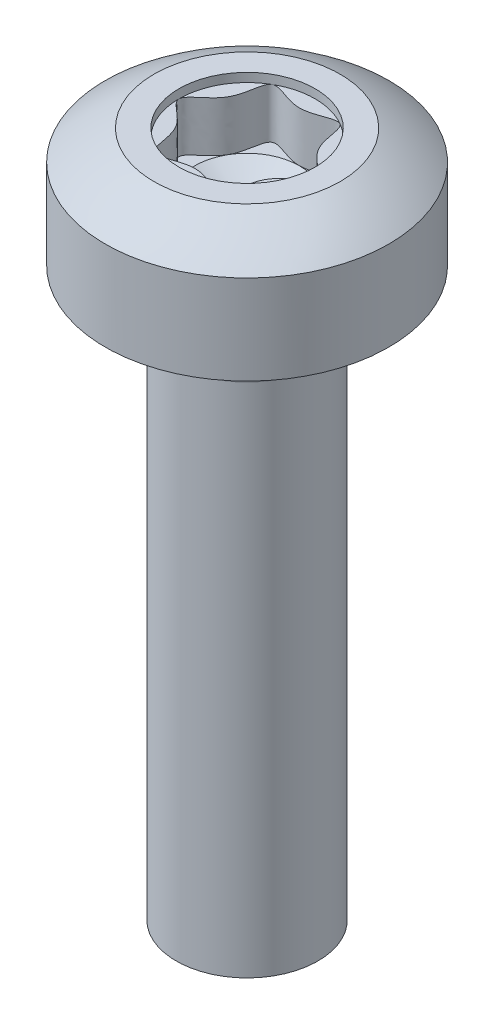
ISO-10303-21;
HEADER;
FILE_DESCRIPTION(('STEP AP214'),'2;1');
FILE_NAME('part.step','',(''),(''),'','','');
FILE_SCHEMA(('AUTOMOTIVE_DESIGN { 1 0 10303 214 1 1 1 1 }'));
ENDSEC;
DATA;
#1=APPLICATION_CONTEXT('core data for automotive mechanical design processes');
#2=APPLICATION_PROTOCOL_DEFINITION('international standard','automotive_design',2000,#1);
#3=PRODUCT_CONTEXT('',#1,'mechanical');
#4=PRODUCT('Part','Part','',(#3));
#5=PRODUCT_RELATED_PRODUCT_CATEGORY('part','',(#4));
#6=PRODUCT_DEFINITION_FORMATION('','',#4);
#7=PRODUCT_DEFINITION_CONTEXT('part definition',#1,'design');
#8=PRODUCT_DEFINITION('design','',#6,#7);
#9=PRODUCT_DEFINITION_SHAPE('','',#8);
#10=(LENGTH_UNIT() NAMED_UNIT(*) SI_UNIT(.MILLI.,.METRE.));
#11=(NAMED_UNIT(*) PLANE_ANGLE_UNIT() SI_UNIT($,.RADIAN.));
#12=(NAMED_UNIT(*) SI_UNIT($,.STERADIAN.) SOLID_ANGLE_UNIT());
#13=UNCERTAINTY_MEASURE_WITH_UNIT(LENGTH_MEASURE(1.E-05),#10,'distance_accuracy_value','');
#14=(GEOMETRIC_REPRESENTATION_CONTEXT(3) GLOBAL_UNCERTAINTY_ASSIGNED_CONTEXT((#13)) GLOBAL_UNIT_ASSIGNED_CONTEXT((#10,
#11,#12)) REPRESENTATION_CONTEXT('',''));
#15=CARTESIAN_POINT('',(0.,0.,0.));
#16=DIRECTION('',(0.,0.,1.));
#17=DIRECTION('',(1.,0.,0.));
#18=AXIS2_PLACEMENT_3D('',#15,#16,#17);
#19=CARTESIAN_POINT('',(0.,0.,0.));
#20=DIRECTION('',(0.,-1.,0.));
#21=DIRECTION('',(0.,0.,-1.));
#22=AXIS2_PLACEMENT_3D('',#19,#20,#21);
#23=CYLINDRICAL_SURFACE('',#22,2.5);
#24=CARTESIAN_POINT('',(0.,10.,0.));
#25=DIRECTION('',(0.,-1.,0.));
#26=DIRECTION('',(0.,0.,-1.));
#27=AXIS2_PLACEMENT_3D('',#24,#25,#26);
#28=CIRCLE('',#27,2.5);
#29=CARTESIAN_POINT('',(0.,10.,-2.5));
#30=VERTEX_POINT('',#29);
#31=EDGE_CURVE('E137',#30,#30,#28,.T.);
#32=ORIENTED_EDGE('',*,*,#31,.F.);
#33=EDGE_LOOP('',(#32));
#34=FACE_BOUND('',#33,.T.);
#35=CARTESIAN_POINT('',(0.,11.575,0.));
#36=DIRECTION('',(0.,-1.,0.));
#37=DIRECTION('',(0.,0.,-1.));
#38=AXIS2_PLACEMENT_3D('',#35,#36,#37);
#39=CIRCLE('',#38,2.5);
#40=CARTESIAN_POINT('',(2.5,11.575,0.));
#41=VERTEX_POINT('',#40);
#42=EDGE_CURVE('E142',#41,#41,#39,.T.);
#43=ORIENTED_EDGE('',*,*,#42,.T.);
#44=EDGE_LOOP('',(#43));
#45=FACE_BOUND('',#44,.T.);
#46=ADVANCED_FACE('F39',(#34,#45),#23,.T.);
#47=CARTESIAN_POINT('',(1.25,10.,0.));
#48=DIRECTION('',(0.,-1.,0.));
#49=DIRECTION('',(0.,0.,-1.));
#50=AXIS2_PLACEMENT_3D('',#47,#48,#49);
#51=PLANE('',#50);
#52=ORIENTED_EDGE('',*,*,#31,.T.);
#53=EDGE_LOOP('',(#52));
#54=FACE_BOUND('',#53,.T.);
#55=CARTESIAN_POINT('',(0.,10.,0.));
#56=DIRECTION('',(0.,-1.,0.));
#57=DIRECTION('',(0.,0.,-1.));
#58=AXIS2_PLACEMENT_3D('',#55,#56,#57);
#59=CIRCLE('',#58,1.25);
#60=CARTESIAN_POINT('',(0.,10.,-1.25));
#61=VERTEX_POINT('',#60);
#62=EDGE_CURVE('E302',#61,#61,#59,.T.);
#63=ORIENTED_EDGE('',*,*,#62,.F.);
#64=EDGE_LOOP('',(#63));
#65=FACE_BOUND('',#64,.T.);
#66=ADVANCED_FACE('F271',(#54,#65),#51,.T.);
#67=CARTESIAN_POINT('',(0.,8.4525010008008,0.));
#68=DIRECTION('',(0.,-1.,0.));
#69=DIRECTION('',(1.,0.,0.));
#70=AXIS2_PLACEMENT_3D('',#67,#68,#69);
#71=SPHERICAL_SURFACE('',#70,4.);
#72=CARTESIAN_POINT('',(0.,12.1,0.));
#73=DIRECTION('',(0.,1.,0.));
#74=DIRECTION('',(0.,0.,1.));
#75=AXIS2_PLACEMENT_3D('',#72,#73,#74);
#76=CIRCLE('',#75,1.6418742493994);
#77=CARTESIAN_POINT('',(1.6418742493994,12.1,0.));
#78=VERTEX_POINT('',#77);
#79=EDGE_CURVE('E146',#78,#78,#76,.T.);
#80=CARTESIAN_POINT('',(2.5,11.575,0.));
#81=CARTESIAN_POINT('',(2.49179811667303,11.5815667633569,0.));
#82=CARTESIAN_POINT('',(2.48357035879982,11.5881012093958,0.));
#83=CARTESIAN_POINT('',(2.46706360738007,11.6011050642602,0.));
#84=CARTESIAN_POINT('',(2.45878461383353,11.6075744730857,0.));
#85=CARTESIAN_POINT('',(2.44217590448631,11.6204478509464,0.));
#86=CARTESIAN_POINT('',(2.43384618868563,11.6268518199815,0.));
#87=CARTESIAN_POINT('',(2.4171365522514,11.6395939208298,0.));
#88=CARTESIAN_POINT('',(2.40875663161786,11.645932052643,0.));
#89=CARTESIAN_POINT('',(2.39194710582831,11.6585420854141,0.));
#90=CARTESIAN_POINT('',(2.3835175006723,11.6648139863721,0.));
#91=CARTESIAN_POINT('',(2.36660912929461,11.67729116799,0.));
#92=CARTESIAN_POINT('',(2.35813036307294,11.6834964486499,0.));
#93=CARTESIAN_POINT('',(2.34112419605702,11.6958400043448,0.));
#94=CARTESIAN_POINT('',(2.33259679526277,11.7019782793798,0.));
#95=CARTESIAN_POINT('',(2.31549388861922,11.7141874426645,0.));
#96=CARTESIAN_POINT('',(2.30691838276991,11.7202583309141,0.));
#97=CARTESIAN_POINT('',(2.28971979851967,11.7323323436503,0.));
#98=CARTESIAN_POINT('',(2.28109672011874,11.738335468137,0.));
#99=CARTESIAN_POINT('',(2.26380352622309,11.7502735805781,0.));
#100=CARTESIAN_POINT('',(2.25513341072836,11.7562085685325,0.));
#101=CARTESIAN_POINT('',(2.23774668102368,11.7680100393707,0.));
#102=CARTESIAN_POINT('',(2.22903006681372,11.7738765222544,0.));
#103=CARTESIAN_POINT('',(2.2115508809445,11.7855406186668,0.));
#104=CARTESIAN_POINT('',(2.20278830928525,11.7913382321955,0.));
#105=CARTESIAN_POINT('',(2.18521775263718,11.8028642298896,0.));
#106=CARTESIAN_POINT('',(2.17640976764836,11.8085926140551,0.));
#107=CARTESIAN_POINT('',(2.15874893128084,11.8199797973138,0.));
#108=CARTESIAN_POINT('',(2.14989607990214,11.8256385964071,0.));
#109=CARTESIAN_POINT('',(2.1321460604806,11.8368862581331,0.));
#110=CARTESIAN_POINT('',(2.12324889243774,11.8424751207659,0.));
#111=CARTESIAN_POINT('',(2.10541079216548,11.8535825625256,0.));
#112=CARTESIAN_POINT('',(2.09646985993607,11.8591011416525,0.));
#113=CARTESIAN_POINT('',(2.07854478648588,11.8700676737193,0.));
#114=CARTESIAN_POINT('',(2.06956064526509,11.8755156266593,0.));
#115=CARTESIAN_POINT('',(2.05154971171041,11.8863405680567,0.));
#116=CARTESIAN_POINT('',(2.04252291937652,11.8917175565141,0.));
#117=CARTESIAN_POINT('',(2.02442724412237,11.9024002350577,0.));
#118=CARTESIAN_POINT('',(2.01535836120211,11.9077059251437,0.));
#119=CARTESIAN_POINT('',(1.99717906791562,11.9182456774829,0.));
#120=CARTESIAN_POINT('',(1.98806865754939,11.9234797397361,0.));
#121=CARTESIAN_POINT('',(1.96980687509001,11.9338759113956,0.));
#122=CARTESIAN_POINT('',(1.96065550299687,11.939038020802,0.));
#123=CARTESIAN_POINT('',(1.94231236534631,11.9492899662223,0.));
#124=CARTESIAN_POINT('',(1.93312059978889,11.9543798022362,0.));
#125=CARTESIAN_POINT('',(1.91469724598067,11.9644868848136,0.));
#126=CARTESIAN_POINT('',(1.90546565772987,11.969504131377,0.));
#127=CARTESIAN_POINT('',(1.88696323177861,11.9794657235031,0.));
#128=CARTESIAN_POINT('',(1.87769239407816,11.9844100690658,0.));
#129=CARTESIAN_POINT('',(1.85911204490851,11.9942255521665,0.));
#130=CARTESIAN_POINT('',(1.84980253343931,11.9990966897047,0.));
#131=CARTESIAN_POINT('',(1.83114541481477,12.0087654542793,0.));
#132=CARTESIAN_POINT('',(1.82179780765943,12.0135630813157,0.));
#133=CARTESIAN_POINT('',(1.80306507811,12.0230845269725,0.));
#134=CARTESIAN_POINT('',(1.7936799557159,12.0278083455928,0.));
#135=CARTESIAN_POINT('',(1.77487277846887,12.0371818810928,0.));
#136=CARTESIAN_POINT('',(1.76545072361593,12.0418315979725,0.));
#137=CARTESIAN_POINT('',(1.74657026651338,12.0510566412438,0.));
#138=CARTESIAN_POINT('',(1.73711186426377,12.0556319676355,0.));
#139=CARTESIAN_POINT('',(1.71815929972841,12.0647079458926,0.));
#140=CARTESIAN_POINT('',(1.70866513744266,12.0692085977582,0.));
#141=CARTESIAN_POINT('',(1.68964164226191,12.0781349472266,0.));
#142=CARTESIAN_POINT('',(1.68011230936692,12.0825606448295,0.));
#143=CARTESIAN_POINT('',(1.6610190651539,12.0913368119422,0.));
#144=CARTESIAN_POINT('',(1.65145515383586,12.095687281452,0.));
#145=CARTESIAN_POINT('',(1.6418742493994,12.1,0.));
#146=B_SPLINE_CURVE_WITH_KNOTS('',3,(#80,#81,#82,#83,#84,#85,#86,#87,#88,#89,#90,#91,#92,#93,
#94,#95,#96,#97,#98,#99,#100,#101,#102,#103,#104,#105,#106,#107,#108,#109,#110,#111,#112,#113,
#114,#115,#116,#117,#118,#119,#120,#121,#122,#123,#124,#125,#126,#127,#128,#129,#130,#131,#132,
#133,#134,#135,#136,#137,#138,#139,#140,#141,#142,#143,#144,#145),.UNSPECIFIED.,.F.,.F.,(4,2,2,
2,2,2,2,2,2,2,2,2,2,2,2,2,2,2,2,2,2,2,2,2,2,2,2,2,2,2,2,2,4),(0.,0.031520379078916,
0.0630407581578305,0.0945611372367455,0.126081516315661,0.157601895394577,0.189122274473491,
0.220642653552406,0.252163032631322,0.283683411710237,0.315203790789152,0.346724169868067,
0.378244548946983,0.409764928025898,0.441285307104812,0.472805686183728,0.504326065262644,
0.535846444341557,0.567366823420474,0.598887202499389,0.630407581578304,0.661927960657219,
0.693448339736134,0.724968718815049,0.756489097893965,0.78800947697288,0.819529856051795,
0.851050235130711,0.882570614209625,0.91409099328854,0.945611372367456,0.977131751446371,
1.00865213052529),.UNSPECIFIED.);
#147=EDGE_CURVE('BSEAM277',#41,#78,#146,.T.);
#148=ORIENTED_EDGE('',*,*,#42,.F.);
#149=ORIENTED_EDGE('',*,*,#79,.F.);
#150=ORIENTED_EDGE('',*,*,#147,.T.);
#151=ORIENTED_EDGE('',*,*,#147,.F.);
#152=EDGE_LOOP('',(#148,#150,#149,#151));
#153=FACE_BOUND('',#152,.T.);
#154=ADVANCED_FACE('F277',(#153),#71,.T.);
#155=CARTESIAN_POINT('',(2.5,12.1,0.));
#156=DIRECTION('',(0.,1.,0.));
#157=DIRECTION('',(0.,0.,1.));
#158=AXIS2_PLACEMENT_3D('',#155,#156,#157);
#159=PLANE('',#158);
#160=CARTESIAN_POINT('',(0.,12.1,0.));
#161=DIRECTION('',(0.,1.,0.));
#162=DIRECTION('',(0.,0.,1.));
#163=AXIS2_PLACEMENT_3D('',#160,#161,#162);
#164=CIRCLE('',#163,1.2);
#165=CARTESIAN_POINT('',(0.,12.1,1.2));
#166=VERTEX_POINT('',#165);
#167=EDGE_CURVE('E322',#166,#166,#164,.T.);
#168=ORIENTED_EDGE('',*,*,#167,.F.);
#169=EDGE_LOOP('',(#168));
#170=FACE_BOUND('',#169,.T.);
#171=ORIENTED_EDGE('',*,*,#79,.T.);
#172=EDGE_LOOP('',(#171));
#173=FACE_BOUND('',#172,.T.);
#174=ADVANCED_FACE('F283',(#170,#173),#159,.T.);
#175=CARTESIAN_POINT('',(0.,9.1,0.));
#176=DIRECTION('',(0.,-1.,0.));
#177=DIRECTION('',(0.,0.,-1.));
#178=AXIS2_PLACEMENT_3D('',#175,#176,#177);
#179=CONICAL_SURFACE('',#178,1.25,0.0765436920382575);
#180=CARTESIAN_POINT('',(0.,9.9,0.));
#181=DIRECTION('',(0.,-1.,0.));
#182=DIRECTION('',(0.,0.,-1.));
#183=AXIS2_PLACEMENT_3D('',#180,#181,#182);
#184=CIRCLE('',#183,1.18864517485948);
#185=CARTESIAN_POINT('',(0.,9.9,-1.18864517485948));
#186=VERTEX_POINT('',#185);
#187=EDGE_CURVE('E299',#186,#186,#184,.T.);
#188=ORIENTED_EDGE('',*,*,#187,.T.);
#189=EDGE_LOOP('',(#188));
#190=FACE_BOUND('',#189,.T.);
#191=CARTESIAN_POINT('',(0.,9.1,0.));
#192=DIRECTION('',(0.,-1.,0.));
#193=DIRECTION('',(0.,0.,-1.));
#194=AXIS2_PLACEMENT_3D('',#191,#192,#193);
#195=CIRCLE('',#194,1.25);
#196=CARTESIAN_POINT('',(0.,9.1,-1.25));
#197=VERTEX_POINT('',#196);
#198=EDGE_CURVE('E149',#197,#197,#195,.T.);
#199=ORIENTED_EDGE('',*,*,#198,.F.);
#200=EDGE_LOOP('',(#199));
#201=FACE_BOUND('',#200,.T.);
#202=ADVANCED_FACE('F313',(#190,#201),#179,.T.);
#203=CARTESIAN_POINT('',(0.,9.90764689698224,0.));
#204=DIRECTION('',(0.,-1.,0.));
#205=DIRECTION('',(0.,0.,-1.));
#206=AXIS2_PLACEMENT_3D('',#203,#204,#205);
#207=TOROIDAL_SURFACE('',#206,1.28835237102175,0.099999999999998);
#208=ORIENTED_EDGE('',*,*,#62,.T.);
#209=EDGE_LOOP('',(#208));
#210=FACE_BOUND('',#209,.T.);
#211=ORIENTED_EDGE('',*,*,#187,.F.);
#212=EDGE_LOOP('',(#211));
#213=FACE_BOUND('',#212,.T.);
#214=ADVANCED_FACE('F294',(#210,#213),#207,.F.);
#215=CARTESIAN_POINT('',(0.,0.,0.));
#216=DIRECTION('',(0.,-1.,0.));
#217=DIRECTION('',(0.,0.,-1.));
#218=AXIS2_PLACEMENT_3D('',#215,#216,#217);
#219=PLANE('',#218);
#220=CARTESIAN_POINT('',(0.,0.,0.));
#221=DIRECTION('',(0.,-1.,0.));
#222=DIRECTION('',(0.,0.,-1.));
#223=AXIS2_PLACEMENT_3D('',#220,#221,#222);
#224=CIRCLE('',#223,1.25);
#225=CARTESIAN_POINT('',(0.,0.,-1.25));
#226=VERTEX_POINT('',#225);
#227=EDGE_CURVE('E133',#226,#226,#224,.T.);
#228=ORIENTED_EDGE('',*,*,#227,.T.);
#229=EDGE_LOOP('',(#228));
#230=FACE_BOUND('',#229,.T.);
#231=ADVANCED_FACE('F41',(#230),#219,.T.);
#232=CARTESIAN_POINT('',(0.,0.,0.));
#233=DIRECTION('',(0.,-1.,0.));
#234=DIRECTION('',(0.,0.,-1.));
#235=AXIS2_PLACEMENT_3D('',#232,#233,#234);
#236=CYLINDRICAL_SURFACE('',#235,1.25);
#237=ORIENTED_EDGE('',*,*,#227,.F.);
#238=EDGE_LOOP('',(#237));
#239=FACE_BOUND('',#238,.T.);
#240=ORIENTED_EDGE('',*,*,#198,.T.);
#241=EDGE_LOOP('',(#240));
#242=FACE_BOUND('',#241,.T.);
#243=ADVANCED_FACE('F285',(#239,#242),#236,.T.);
#244=CARTESIAN_POINT('',(0.,11.944,0.));
#245=DIRECTION('',(0.,1.,0.));
#246=DIRECTION('',(0.,0.,1.));
#247=AXIS2_PLACEMENT_3D('',#244,#245,#246);
#248=CYLINDRICAL_SURFACE('',#247,1.2);
#249=ORIENTED_EDGE('',*,*,#167,.T.);
#250=EDGE_LOOP('',(#249));
#251=FACE_BOUND('',#250,.T.);
#252=CARTESIAN_POINT('',(0.,11.944,0.));
#253=DIRECTION('',(0.,1.,0.));
#254=DIRECTION('',(0.,0.,1.));
#255=AXIS2_PLACEMENT_3D('',#252,#253,#254);
#256=CIRCLE('',#255,1.2);
#257=CARTESIAN_POINT('',(-0.599999999999994,11.944,1.03923048454133));
#258=VERTEX_POINT('',#257);
#259=CARTESIAN_POINT('',(0.600000000000006,11.944,1.03923048454132));
#260=VERTEX_POINT('',#259);
#261=EDGE_CURVE('E119',#258,#260,#256,.T.);
#262=ORIENTED_EDGE('',*,*,#261,.F.);
#263=CARTESIAN_POINT('',(-1.2,11.944,0.));
#264=VERTEX_POINT('',#263);
#265=EDGE_CURVE('E324',#264,#258,#256,.T.);
#266=ORIENTED_EDGE('',*,*,#265,.F.);
#267=CARTESIAN_POINT('',(-0.600000000000005,11.944,-1.03923048454132));
#268=VERTEX_POINT('',#267);
#269=EDGE_CURVE('E374',#268,#264,#256,.T.);
#270=ORIENTED_EDGE('',*,*,#269,.F.);
#271=CARTESIAN_POINT('',(0.599999999999995,11.944,-1.03923048454133));
#272=VERTEX_POINT('',#271);
#273=EDGE_CURVE('E112',#272,#268,#256,.T.);
#274=ORIENTED_EDGE('',*,*,#273,.F.);
#275=CARTESIAN_POINT('',(1.2,11.944,0.));
#276=VERTEX_POINT('',#275);
#277=EDGE_CURVE('E102',#276,#272,#256,.T.);
#278=ORIENTED_EDGE('',*,*,#277,.F.);
#279=EDGE_CURVE('E57',#260,#276,#256,.T.);
#280=ORIENTED_EDGE('',*,*,#279,.F.);
#281=EDGE_LOOP('',(#262,#266,#270,#274,#278,#280));
#282=FACE_BOUND('',#281,.T.);
#283=ADVANCED_FACE('F109',(#251,#282),#248,.F.);
#284=CARTESIAN_POINT('',(0.,11.944,0.));
#285=DIRECTION('',(0.,1.,0.));
#286=DIRECTION('',(0.,0.,1.));
#287=AXIS2_PLACEMENT_3D('',#284,#285,#286);
#288=PLANE('',#287);
#289=CARTESIAN_POINT('',(0.,11.944,0.923076923076923));
#290=CARTESIAN_POINT('',(0.246244913072035,11.944,0.923076923076921));
#291=CARTESIAN_POINT('',(0.738734739216103,11.944,1.27952610163842));
#292=CARTESIAN_POINT('',(0.645061043135613,11.944,0.372426166898084));
#293=CARTESIAN_POINT('',(1.47746947843219,11.944,0.));
#294=CARTESIAN_POINT('',(0.645061043135611,11.944,-0.372426166898088));
#295=CARTESIAN_POINT('',(0.738734739216091,11.944,-1.27952610163843));
#296=CARTESIAN_POINT('',(0.,11.944,-0.744852333796172));
#297=CARTESIAN_POINT('',(-0.738734739216104,11.944,-1.27952610163842));
#298=CARTESIAN_POINT('',(-0.645061043135612,11.944,-0.372426166898085));
#299=CARTESIAN_POINT('',(-1.47746947843219,11.944,0.));
#300=CARTESIAN_POINT('',(-0.645061043135611,11.944,0.372426166898087));
#301=CARTESIAN_POINT('',(-0.738734739216091,11.944,1.27952610163843));
#302=CARTESIAN_POINT('',(-0.24624491307203,11.944,0.923076923076926));
#303=CARTESIAN_POINT('',(0.,11.944,0.923076923076923));
#304=B_SPLINE_CURVE_WITH_KNOTS('',3,(#289,#290,#291,#292,#293,#294,#295,#296,#297,#298,#299,
#300,#301,#302,#303),.UNSPECIFIED.,.T.,.F.,(4,1,1,1,1,1,1,1,1,1,1,1,4),(0.,0.0833333333333341,
0.166666666666667,0.250000000000001,0.333333333333333,0.416666666666667,0.5,0.583333333333334,
0.666666666666667,0.750000000000001,0.833333333333333,0.916666666666667,1.),.UNSPECIFIED.);
#305=EDGE_CURVE('E11',#258,#264,#304,.F.);
#306=ORIENTED_EDGE('',*,*,#305,.T.);
#307=ORIENTED_EDGE('',*,*,#265,.T.);
#308=EDGE_LOOP('',(#306,#307));
#309=FACE_BOUND('',#308,.T.);
#310=ADVANCED_FACE('F292',(#309),#288,.T.);
#311=EDGE_CURVE('E50',#264,#268,#304,.F.);
#312=ORIENTED_EDGE('',*,*,#311,.T.);
#313=ORIENTED_EDGE('',*,*,#269,.T.);
#314=EDGE_LOOP('',(#312,#313));
#315=FACE_BOUND('',#314,.T.);
#316=ADVANCED_FACE('F363',(#315),#288,.T.);
#317=EDGE_CURVE('E106',#268,#272,#304,.F.);
#318=ORIENTED_EDGE('',*,*,#317,.T.);
#319=ORIENTED_EDGE('',*,*,#273,.T.);
#320=EDGE_LOOP('',(#318,#319));
#321=FACE_BOUND('',#320,.T.);
#322=ADVANCED_FACE('F368',(#321),#288,.T.);
#323=EDGE_CURVE('E100',#272,#276,#304,.F.);
#324=ORIENTED_EDGE('',*,*,#323,.T.);
#325=ORIENTED_EDGE('',*,*,#277,.T.);
#326=EDGE_LOOP('',(#324,#325));
#327=FACE_BOUND('',#326,.T.);
#328=ADVANCED_FACE('F101',(#327),#288,.T.);
#329=EDGE_CURVE('E107',#276,#260,#304,.F.);
#330=ORIENTED_EDGE('',*,*,#329,.T.);
#331=ORIENTED_EDGE('',*,*,#279,.T.);
#332=EDGE_LOOP('',(#330,#331));
#333=FACE_BOUND('',#332,.T.);
#334=ADVANCED_FACE('F116',(#333),#288,.T.);
#335=EDGE_CURVE('E43',#260,#258,#304,.F.);
#336=ORIENTED_EDGE('',*,*,#335,.T.);
#337=ORIENTED_EDGE('',*,*,#261,.T.);
#338=EDGE_LOOP('',(#336,#337));
#339=FACE_BOUND('',#338,.T.);
#340=ADVANCED_FACE('F353',(#339),#288,.T.);
#341=CARTESIAN_POINT('',(0.,10.5270612899788,0.));
#342=DIRECTION('',(0.,1.,0.));
#343=DIRECTION('',(0.,0.,1.));
#344=AXIS2_PLACEMENT_3D('',#341,#342,#343);
#345=CONICAL_SURFACE('',#344,0.,1.04719755119659);
#346=CARTESIAN_POINT('',(-0.000394126476688304,11.06,-0.92307621114213));
#347=CARTESIAN_POINT('',(0.254474389957725,11.06,-0.923228980664006));
#348=CARTESIAN_POINT('',(0.45813457141788,11.06,-0.804252217712499));
#349=CARTESIAN_POINT('',(0.674117120568077,11.06,-0.678076819224342));
#350=CARTESIAN_POINT('',(0.801106699689692,11.06,-0.463002875994158));
#351=CARTESIAN_POINT('',(0.922045512170781,11.06,-0.258176720416671));
#352=CARTESIAN_POINT('',(0.923065253147436,11.06,-0.00595049263792113));
#353=CARTESIAN_POINT('',(0.924094367191551,11.06,0.248594101767673));
#354=CARTESIAN_POINT('',(0.806436681483708,11.06,0.454056413952676));
#355=B_SPLINE_CURVE_WITH_KNOTS('',2,(#346,#347,#348,#349,#350,#351,#352,#353,#354),
.UNSPECIFIED.,.F.,.F.,(3,2,2,2,3),(0.,0.25,0.5,0.75,1.),.UNSPECIFIED.);
#356=CARTESIAN_POINT('',(0.000503298113073371,11.06,-0.923077204547766));
#357=VERTEX_POINT('',#356);
#358=CARTESIAN_POINT('',(0.785999713706478,11.06,-0.485837326819572));
#359=VERTEX_POINT('',#358);
#360=EDGE_CURVE('E118',#357,#359,#355,.T.);
#361=ORIENTED_EDGE('',*,*,#360,.F.);
#362=CARTESIAN_POINT('',(0.,11.06,0.));
#363=DIRECTION('',(0.,1.,0.));
#364=DIRECTION('',(0.000545240147370865,0.,-0.99999985135658));
#365=AXIS2_PLACEMENT_3D('',#362,#363,#364);
#366=CIRCLE('',#365,0.923076923077);
#367=CARTESIAN_POINT('',(-0.804454306914714,11.06,-0.455110202791113));
#368=VERTEX_POINT('',#367);
#369=EDGE_CURVE('E124',#357,#368,#366,.T.);
#370=ORIENTED_EDGE('',*,*,#369,.T.);
#371=CARTESIAN_POINT('',(0.,11.06,0.));
#372=DIRECTION('',(0.,1.,0.));
#373=DIRECTION('',(-0.870374466387926,0.,-0.492390381973423));
#374=AXIS2_PLACEMENT_3D('',#371,#372,#373);
#375=CIRCLE('',#374,0.923076923077);
#376=CARTESIAN_POINT('',(-0.785983134370913,11.06,0.485863810223388));
#377=VERTEX_POINT('',#376);
#378=EDGE_CURVE('E122',#368,#377,#375,.T.);
#379=ORIENTED_EDGE('',*,*,#378,.T.);
#380=CARTESIAN_POINT('',(0.,11.06,0.));
#381=DIRECTION('',(0.,1.,0.));
#382=DIRECTION('',(-0.850608822829452,0.,0.525799040056839));
#383=AXIS2_PLACEMENT_3D('',#380,#381,#382);
#384=CIRCLE('',#383,0.923076923077);
#385=CARTESIAN_POINT('',(-0.00117277545002488,11.06,0.923075678455339));
#386=VERTEX_POINT('',#385);
#387=EDGE_CURVE('E128',#377,#386,#384,.T.);
#388=ORIENTED_EDGE('',*,*,#387,.T.);
#389=CARTESIAN_POINT('',(0.,11.06,0.));
#390=DIRECTION('',(0.,1.,0.));
#391=DIRECTION('',(-0.00160247870343284,0.,0.999998716030178));
#392=AXIS2_PLACEMENT_3D('',#389,#390,#391);
#393=CIRCLE('',#392,0.923076923077);
#394=CARTESIAN_POINT('',(0.804457605996581,11.06,0.455104432020474));
#395=VERTEX_POINT('',#394);
#396=EDGE_CURVE('E65',#386,#395,#393,.T.);
#397=ORIENTED_EDGE('',*,*,#396,.T.);
#398=CARTESIAN_POINT('',(0.,11.06,0.));
#399=DIRECTION('',(0.,1.,0.));
#400=DIRECTION('',(0.870378007416163,0.,0.492384122617971));
#401=AXIS2_PLACEMENT_3D('',#398,#399,#400);
#402=CIRCLE('',#401,0.923076923077);
#403=EDGE_CURVE('E132',#395,#359,#402,.T.);
#404=ORIENTED_EDGE('',*,*,#403,.T.);
#405=EDGE_LOOP('',(#361,#370,#379,#388,#397,#404));
#406=FACE_BOUND('',#405,.T.);
#407=CARTESIAN_POINT('',(0.,10.5270612899788,0.));
#408=VERTEX_POINT('',#407);
#409=VERTEX_LOOP('',#408);
#410=FACE_BOUND('',#409,.T.);
#411=ADVANCED_FACE('F175',(#406,#410),#345,.F.);
#412=CARTESIAN_POINT('',(0.,11.06,0.));
#413=DIRECTION('',(0.,1.,0.));
#414=DIRECTION('',(0.,0.,1.));
#415=AXIS2_PLACEMENT_3D('',#412,#413,#414);
#416=PLANE('',#415);
#417=ORIENTED_EDGE('',*,*,#360,.T.);
#418=CARTESIAN_POINT('',(0.000448557537363469,11.06,-0.923077120111182));
#419=CARTESIAN_POINT('',(0.246543900301105,11.06,-0.923293269379218));
#420=CARTESIAN_POINT('',(0.729447696743118,11.06,-1.27263774642242));
#421=CARTESIAN_POINT('',(0.678440186885354,11.06,-0.697220714218928));
#422=CARTESIAN_POINT('',(0.786141930724422,11.06,-0.485987273540289));
#423=B_SPLINE_CURVE_WITH_KNOTS('',3,(#418,#419,#420,#421,#422),.UNSPECIFIED.,.F.,.F.,(4,1,4),
(0.336470878575432,0.419753612153014,0.49994940024425),.UNSPECIFIED.);
#424=EDGE_CURVE('E242',#359,#357,#423,.F.);
#425=ORIENTED_EDGE('',*,*,#424,.T.);
#426=EDGE_LOOP('',(#417,#425));
#427=FACE_BOUND('',#426,.T.);
#428=ADVANCED_FACE('F174',(#427),#416,.T.);
#429=ORIENTED_EDGE('',*,*,#369,.F.);
#430=CARTESIAN_POINT('',(-0.803516205869069,11.06,-0.454550596886031));
#431=CARTESIAN_POINT('',(-0.802128622472913,11.06,-0.456869234436114));
#432=CARTESIAN_POINT('',(-0.675942990397295,11.06,-0.671475030323482));
#433=CARTESIAN_POINT('',(-0.738734739216104,11.06,-1.27952610163842));
#434=CARTESIAN_POINT('',(-0.24609539388256,11.06,-0.922968705628685));
#435=CARTESIAN_POINT('',(0.000299038378948313,11.06,-0.92307698878624));
#436=CARTESIAN_POINT('',(0.000448557537364421,11.06,-0.923077120111182));
#437=B_SPLINE_CURVE_WITH_KNOTS('',3,(#430,#431,#432,#433,#434,#435,#436),.UNSPECIFIED.,.F.,.F.,
(4,1,1,1,4),(0.49994940024425,0.500863792738666,0.584197126071999,0.667530459405333,
0.667581059161083),.UNSPECIFIED.);
#438=EDGE_CURVE('E231',#357,#368,#437,.F.);
#439=ORIENTED_EDGE('',*,*,#438,.T.);
#440=EDGE_LOOP('',(#429,#439));
#441=FACE_BOUND('',#440,.T.);
#442=ADVANCED_FACE('F241',(#441),#416,.T.);
#443=ORIENTED_EDGE('',*,*,#378,.F.);
#444=CARTESIAN_POINT('',(-0.786127686707836,11.06,0.486015211998948));
#445=CARTESIAN_POINT('',(-0.790345652947228,11.06,0.477741448442663));
#446=CARTESIAN_POINT('',(-0.91207187279833,11.06,0.252963394063341));
#447=CARTESIAN_POINT('',(-1.4744248863301,11.06,0.00136217476695108));
#448=CARTESIAN_POINT('',(-0.928586298345998,11.06,-0.2455597617315));
#449=CARTESIAN_POINT('',(-0.803516205869069,11.06,-0.454550596886032));
#450=B_SPLINE_CURVE_WITH_KNOTS('',3,(#444,#445,#446,#447,#448,#449),.UNSPECIFIED.,.F.,.F.,(4,1,
1,4),(0.667581059161083,0.670722140007336,0.754055473340669,0.836474414179586),.UNSPECIFIED.);
#451=EDGE_CURVE('E223',#368,#377,#450,.F.);
#452=ORIENTED_EDGE('',*,*,#451,.T.);
#453=EDGE_LOOP('',(#443,#452));
#454=FACE_BOUND('',#453,.T.);
#455=ADVANCED_FACE('F173',(#454),#416,.T.);
#456=ORIENTED_EDGE('',*,*,#387,.F.);
#457=CARTESIAN_POINT('',(-0.000605745227778042,11.06,0.923077282340431));
#458=CARTESIAN_POINT('',(-0.246648649994927,11.06,0.923369041547251));
#459=CARTESIAN_POINT('',(-0.72943172156385,11.06,1.27256778080042));
#460=CARTESIAN_POINT('',(-0.678442392948254,11.06,0.697245603256001));
#461=CARTESIAN_POINT('',(-0.786127686707836,11.06,0.486015211998948));
#462=B_SPLINE_CURVE_WITH_KNOTS('',3,(#457,#458,#459,#460,#461),.UNSPECIFIED.,.F.,.F.,(4,1,4),
(0.836474414179586,0.919739416117797,0.999931668604878),.UNSPECIFIED.);
#463=EDGE_CURVE('E236',#377,#386,#462,.F.);
#464=ORIENTED_EDGE('',*,*,#463,.T.);
#465=EDGE_LOOP('',(#456,#464));
#466=FACE_BOUND('',#465,.T.);
#467=ADVANCED_FACE('F263',(#466),#416,.T.);
#468=ORIENTED_EDGE('',*,*,#396,.F.);
#469=CARTESIAN_POINT('',(0.80351966395958,11.06,0.45454481853672));
#470=CARTESIAN_POINT('',(0.799541930541332,11.06,0.461186339356087));
#471=CARTESIAN_POINT('',(0.795719692199885,11.06,0.467919530600817));
#472=CARTESIAN_POINT('',(0.788367932598847,11.06,0.481548447549102));
#473=CARTESIAN_POINT('',(0.784838559499828,11.06,0.48844425328125));
#474=CARTESIAN_POINT('',(0.778054970520859,11.06,0.502377548806635));
#475=CARTESIAN_POINT('',(0.774801022019237,11.06,0.509415168249882));
#476=CARTESIAN_POINT('',(0.768549735096112,11.06,0.523611725151033));
#477=CARTESIAN_POINT('',(0.765552661627672,11.06,0.530770778960416));
#478=CARTESIAN_POINT('',(0.75979696630718,11.06,0.545189823320059));
#479=CARTESIAN_POINT('',(0.757038518066536,11.06,0.552449882972579));
#480=CARTESIAN_POINT('',(0.751742031145181,11.06,0.567050448753743));
#481=CARTESIAN_POINT('',(0.749204015824843,11.06,0.574390963315986));
#482=CARTESIAN_POINT('',(0.741899019039469,11.06,0.596485080414534));
#483=CARTESIAN_POINT('',(0.73743068829161,11.06,0.611337789815078));
#484=CARTESIAN_POINT('',(0.729160942832997,11.06,0.641117353456816));
#485=CARTESIAN_POINT('',(0.725355281557082,11.06,0.656043053704034));
#486=CARTESIAN_POINT('',(0.718265459581305,11.06,0.685807786018235));
#487=CARTESIAN_POINT('',(0.714975059739519,11.06,0.700645347960553));
#488=CARTESIAN_POINT('',(0.705804761576766,11.06,0.7441874880237));
#489=CARTESIAN_POINT('',(0.700356101086561,11.06,0.772980249191312));
#490=CARTESIAN_POINT('',(0.692269173468529,11.06,0.815362545361481));
#491=CARTESIAN_POINT('',(0.689664533851541,11.06,0.828960087821603));
#492=CARTESIAN_POINT('',(0.684383895361029,11.06,0.855415092642425));
#493=CARTESIAN_POINT('',(0.681718473316324,11.06,0.868274617349493));
#494=CARTESIAN_POINT('',(0.676161490324225,11.06,0.893091275052802));
#495=CARTESIAN_POINT('',(0.673295086161842,11.06,0.905053793206747));
#496=CARTESIAN_POINT('',(0.668607043207249,11.06,0.922536645061785));
#497=CARTESIAN_POINT('',(0.667033085903273,11.06,0.928122837678444));
#498=CARTESIAN_POINT('',(0.663770619281647,11.06,0.939006409851698));
#499=CARTESIAN_POINT('',(0.662089722540414,11.06,0.94430604723887));
#500=CARTESIAN_POINT('',(0.658593793691292,11.06,0.954595346054375));
#501=CARTESIAN_POINT('',(0.656788240393166,11.06,0.95958820179407));
#502=CARTESIAN_POINT('',(0.653022425569196,11.06,0.969243172767159));
#503=CARTESIAN_POINT('',(0.651073663187483,11.06,0.973909699045109));
#504=CARTESIAN_POINT('',(0.647980776763709,11.06,0.980728959036662));
#505=CARTESIAN_POINT('',(0.646943487525578,11.06,0.982930285974703));
#506=CARTESIAN_POINT('',(0.644824288020671,11.06,0.987242456781297));
#507=CARTESIAN_POINT('',(0.643744174817123,11.06,0.98935417991791));
#508=CARTESIAN_POINT('',(0.641537014181358,11.06,0.993484444846448));
#509=CARTESIAN_POINT('',(0.640411852399451,11.06,0.995503991503454));
#510=CARTESIAN_POINT('',(0.638112205930299,11.06,0.999447230234968));
#511=CARTESIAN_POINT('',(0.636939671177068,11.06,1.00137205576312));
#512=CARTESIAN_POINT('',(0.634542947409563,11.06,1.00512316479084));
#513=CARTESIAN_POINT('',(0.633320735334164,11.06,1.00695070747821));
#514=CARTESIAN_POINT('',(0.63082234572871,11.06,1.0105045830723));
#515=CARTESIAN_POINT('',(0.629548125267455,11.06,1.01223228703011));
#516=CARTESIAN_POINT('',(0.626943509577046,11.06,1.01558378747156));
#517=CARTESIAN_POINT('',(0.625614992433683,11.06,1.01720903994633));
#518=CARTESIAN_POINT('',(0.622899460721576,11.06,1.02035313587262));
#519=CARTESIAN_POINT('',(0.621514182154129,11.06,1.02187347004894));
#520=CARTESIAN_POINT('',(0.619381851423189,11.06,1.02408154097413));
#521=CARTESIAN_POINT('',(0.618667170888165,11.06,1.02480072639314));
#522=CARTESIAN_POINT('',(0.617222640747477,11.06,1.02621170575735));
#523=CARTESIAN_POINT('',(0.616492963912233,11.06,1.02690367614523));
#524=CARTESIAN_POINT('',(0.615018195407867,11.06,1.02825988711806));
#525=CARTESIAN_POINT('',(0.614273257429889,11.06,1.02892429478708));
#526=CARTESIAN_POINT('',(0.612767696167845,11.06,1.03022507806522));
#527=CARTESIAN_POINT('',(0.612007205865703,11.06,1.03086160747));
#528=CARTESIAN_POINT('',(0.610470278183619,11.06,1.03210632672494));
#529=CARTESIAN_POINT('',(0.609693951487259,11.06,1.03271465316114));
#530=CARTESIAN_POINT('',(0.6081250896776,11.06,1.03390266667911));
#531=CARTESIAN_POINT('',(0.607332641798793,11.06,1.03448246889203));
#532=CARTESIAN_POINT('',(0.605731274860084,11.06,1.03561313273507));
#533=CARTESIAN_POINT('',(0.60492241889874,11.06,1.03616408368685));
#534=CARTESIAN_POINT('',(0.603287984694976,11.06,1.03723676718298));
#535=CARTESIAN_POINT('',(0.602462445221813,11.06,1.03775855877049));
#536=CARTESIAN_POINT('',(0.600794351325595,11.06,1.03877257992252));
#537=CARTESIAN_POINT('',(0.599951811817159,11.06,1.03926483401261));
#538=CARTESIAN_POINT('',(0.598249607369072,11.06,1.04021972913559));
#539=CARTESIAN_POINT('',(0.597389934692733,11.06,1.04068235637375));
#540=CARTESIAN_POINT('',(0.595653668134895,11.06,1.04157851998942));
#541=CARTESIAN_POINT('',(0.594777047366274,11.06,1.04201200424461));
#542=CARTESIAN_POINT('',(0.593007025019203,11.06,1.04285030551513));
#543=CARTESIAN_POINT('',(0.592113581348368,11.06,1.04325503360291));
#544=CARTESIAN_POINT('',(0.590310064701858,11.06,1.04403627061404));
#545=CARTESIAN_POINT('',(0.589399938280112,11.06,1.04441265606693));
#546=CARTESIAN_POINT('',(0.587563202678819,11.06,1.04513764594582));
#547=CARTESIAN_POINT('',(0.586636532238205,11.06,1.04548609500553));
#548=CARTESIAN_POINT('',(0.584766840874175,11.06,1.04615565139561));
#549=CARTESIAN_POINT('',(0.583823754001694,11.06,1.04647657451685));
#550=CARTESIAN_POINT('',(0.581921403467281,11.06,1.04709150687041));
#551=CARTESIAN_POINT('',(0.580962072270548,11.06,1.04738530627063));
#552=CARTESIAN_POINT('',(0.578047575222315,11.06,1.04823056497038));
#553=CARTESIAN_POINT('',(0.576079351454508,11.06,1.04873753245408));
#554=CARTESIAN_POINT('',(0.572080201634643,11.06,1.04964982295956));
#555=CARTESIAN_POINT('',(0.57004879629159,11.06,1.0500530167768));
#556=CARTESIAN_POINT('',(0.565924101110569,11.06,1.05076131313521));
#557=CARTESIAN_POINT('',(0.563830419847791,11.06,1.05106411999905));
#558=CARTESIAN_POINT('',(0.559582189750294,11.06,1.05157501114049));
#559=CARTESIAN_POINT('',(0.557427359626052,11.06,1.05178072314238));
#560=CARTESIAN_POINT('',(0.553057773222921,11.06,1.05210072961189));
#561=CARTESIAN_POINT('',(0.55084284665994,11.06,1.05221265097879));
#562=CARTESIAN_POINT('',(0.546354028664981,11.06,1.05234830512759));
#563=CARTESIAN_POINT('',(0.544080070599031,11.06,1.05236972205146));
#564=CARTESIAN_POINT('',(0.539474155840203,11.06,1.05232754636753));
#565=CARTESIAN_POINT('',(0.537142222415584,11.06,1.05226173759016));
#566=CARTESIAN_POINT('',(0.532421343955193,11.06,1.05204824804459));
#567=CARTESIAN_POINT('',(0.530032496042844,11.06,1.05189847938796));
#568=CARTESIAN_POINT('',(0.525198777521736,11.06,1.05152019741124));
#569=CARTESIAN_POINT('',(0.522754060926424,11.06,1.05128974241373));
#570=CARTESIAN_POINT('',(0.517809669481366,11.06,1.05075314568899));
#571=CARTESIAN_POINT('',(0.515310191474547,11.06,1.05044521595352));
#572=CARTESIAN_POINT('',(0.507636797023766,11.06,1.04940001690739));
#573=CARTESIAN_POINT('',(0.502477171127822,11.06,1.04855713236261));
#574=CARTESIAN_POINT('',(0.491950358683536,11.06,1.04661238281372));
#575=CARTESIAN_POINT('',(0.486585172210076,11.06,1.04549998248903));
#576=CARTESIAN_POINT('',(0.475655357484162,11.06,1.04303923571958));
#577=CARTESIAN_POINT('',(0.470092634794531,11.06,1.04168251668241));
#578=CARTESIAN_POINT('',(0.45278362735859,11.06,1.03721082737961));
#579=CARTESIAN_POINT('',(0.441106195039959,11.06,1.03383186520561));
#580=CARTESIAN_POINT('',(0.417055549930204,11.06,1.02644604935516));
#581=CARTESIAN_POINT('',(0.404691056489549,11.06,1.02241176670883));
#582=CARTESIAN_POINT('',(0.379338101638178,11.06,1.01390046542769));
#583=CARTESIAN_POINT('',(0.36635377267075,11.06,1.00941130926759));
#584=CARTESIAN_POINT('',(0.325839955845116,11.06,0.995328042284622));
#585=CARTESIAN_POINT('',(0.298336088874104,11.06,0.985657337507671));
#586=CARTESIAN_POINT('',(0.256269629408671,11.06,0.971752099273243));
#587=CARTESIAN_POINT('',(0.24183523721461,11.06,0.967137226102888));
#588=CARTESIAN_POINT('',(0.212623399533294,11.06,0.95826976878273));
#589=CARTESIAN_POINT('',(0.19784402597985,11.06,0.954023480872755));
#590=CARTESIAN_POINT('',(0.168056461303552,11.06,0.94611617712417));
#591=CARTESIAN_POINT('',(0.153047549755197,11.06,0.942457817158529));
#592=CARTESIAN_POINT('',(0.130389336656841,11.06,0.937555436320489));
#593=CARTESIAN_POINT('',(0.122803349836651,11.06,0.936017356349511));
#594=CARTESIAN_POINT('',(0.107588280019665,11.06,0.933162179001317));
#595=CARTESIAN_POINT('',(0.0999591902094195,11.06,0.93184511763238));
#596=CARTESIAN_POINT('',(0.0846665211227815,11.06,0.929457903546796));
#597=CARTESIAN_POINT('',(0.0770029629554969,11.06,0.928387616390567));
#598=CARTESIAN_POINT('',(0.0616497258850402,11.06,0.926519876229031));
#599=CARTESIAN_POINT('',(0.0539600788087169,11.06,0.925722164359878));
#600=CARTESIAN_POINT('',(0.0385633624292637,11.06,0.924425440067515));
#601=CARTESIAN_POINT('',(0.0308563188572223,11.06,0.923926124158842));
#602=CARTESIAN_POINT('',(0.0154325280707174,11.06,0.923251980225628));
#603=CARTESIAN_POINT('',(0.0077157915483682,11.06,0.923076923363491));
#604=CARTESIAN_POINT('',(-5.04787995003703E-05,11.06,0.923076923075048));
#605=CARTESIAN_POINT('',(-0.000100957558554616,11.06,0.923076930565824));
#606=CARTESIAN_POINT('',(-0.000201915093239367,11.06,0.923076960517593));
#607=CARTESIAN_POINT('',(-0.000252393868869873,11.06,0.923076982978586));
#608=CARTESIAN_POINT('',(-0.000403830203194858,11.06,0.923077072807764));
#609=CARTESIAN_POINT('',(-0.00050478775610505,11.06,0.923077162622147));
#610=CARTESIAN_POINT('',(-0.000605745227777058,11.06,0.923077282340431));
#611=B_SPLINE_CURVE_WITH_KNOTS('',3,(#469,#470,#471,#472,#473,#474,#475,#476,#477,#478,#479,
#480,#481,#482,#483,#484,#485,#486,#487,#488,#489,#490,#491,#492,#493,#494,#495,#496,#497,#498,
#499,#500,#501,#502,#503,#504,#505,#506,#507,#508,#509,#510,#511,#512,#513,#514,#515,#516,#517,
#518,#519,#520,#521,#522,#523,#524,#525,#526,#527,#528,#529,#530,#531,#532,#533,#534,#535,#536,
#537,#538,#539,#540,#541,#542,#543,#544,#545,#546,#547,#548,#549,#550,#551,#552,#553,#554,#555,
#556,#557,#558,#559,#560,#561,#562,#563,#564,#565,#566,#567,#568,#569,#570,#571,#572,#573,#574,
#575,#576,#577,#578,#579,#580,#581,#582,#583,#584,#585,#586,#587,#588,#589,#590,#591,#592,#593,
#594,#595,#596,#597,#598,#599,#600,#601,#602,#603,#604,#605,#606,#607,#608,#609,#610),
.UNSPECIFIED.,.F.,.F.,(4,2,2,2,2,2,2,2,2,2,2,2,2,2,2,2,2,2,2,2,2,2,2,2,2,2,2,2,2,2,2,2,2,2,2,2,
2,2,2,2,2,2,2,2,2,2,2,2,2,2,2,2,2,2,2,2,2,2,2,2,2,2,2,2,2,2,2,2,2,2,4),(0.,0.0232208399588508,
0.0464533566190771,0.0697081744126724,0.0929866966939903,0.116282015234822,0.139579799491759,
0.186089997620094,0.232290200455854,0.277878537168323,0.365781308484869,0.407315781608166,
0.446712003370682,0.483603125579155,0.501011827690503,0.517687606605254,0.533610704372802,
0.548773715085573,0.556073082789055,0.563187461476967,0.570121367383367,0.576881031391277,
0.583474613414235,0.589912423907941,0.596207142674409,0.602374020715212,0.605415354445764,
0.60843171204972,0.611425787252376,0.614400453652817,0.617358763080645,0.620303942106142,
0.623239386585546,0.626168654172051,0.629095454877278,0.632023608583583,0.634956867153419,
0.637898833944368,0.640852953100588,0.643822501462807,0.646810582522103,0.649820122364465,
0.65591374369328,0.662123896614693,0.668467586038837,0.674959132891878,0.681610355220814,
0.688430777960993,0.695427854085632,0.702607184513722,0.70997272833523,0.71752699829407,
0.733204493717074,0.749638587274097,0.766813138338544,0.80326839860973,0.84228344713029,
0.883498604060568,0.970955825852469,1.01641331490811,1.06253659627957,1.10886270658054,
1.13208105252797,1.1553031775359,1.17851262136252,1.20169996159288,1.22486367868145,
1.24801104232681,1.24816247865334,1.24831391498603,1.24861678769107),.UNSPECIFIED.);
#612=EDGE_CURVE('E261',#386,#395,#611,.F.);
#613=ORIENTED_EDGE('',*,*,#612,.T.);
#614=EDGE_LOOP('',(#468,#613));
#615=FACE_BOUND('',#614,.T.);
#616=ADVANCED_FACE('F172',(#615),#416,.T.);
#617=ORIENTED_EDGE('',*,*,#403,.F.);
#618=CARTESIAN_POINT('',(0.786141930724421,11.06,-0.48598727354029));
#619=CARTESIAN_POINT('',(0.790355607053203,11.06,-0.477723067993492));
#620=CARTESIAN_POINT('',(0.912083645065216,11.06,-0.25295812705733));
#621=CARTESIAN_POINT('',(1.47442235714601,11.06,-0.00136330634406393));
#622=CARTESIAN_POINT('',(0.928591301187106,11.06,0.245557498577275));
#623=CARTESIAN_POINT('',(0.80351966395958,11.06,0.45454481853672));
#624=B_SPLINE_CURVE_WITH_KNOTS('',3,(#618,#619,#620,#621,#622,#623),.UNSPECIFIED.,.F.,.F.,(4,1,
1,4),(0.16758181875937,0.170719364001468,0.254052697334801,0.336470878575432),.UNSPECIFIED.);
#625=EDGE_CURVE('E154',#395,#359,#624,.F.);
#626=ORIENTED_EDGE('',*,*,#625,.T.);
#627=EDGE_LOOP('',(#617,#626));
#628=FACE_BOUND('',#627,.T.);
#629=ADVANCED_FACE('F162',(#628),#416,.T.);
#630=CARTESIAN_POINT('',(0.,11.06,0.923076923076923));
#631=CARTESIAN_POINT('',(0.246244913072035,11.06,0.923076923076921));
#632=CARTESIAN_POINT('',(0.738734739216103,11.06,1.27952610163842));
#633=CARTESIAN_POINT('',(0.645061043135613,11.06,0.372426166898084));
#634=CARTESIAN_POINT('',(1.47746947843219,11.06,0.));
#635=CARTESIAN_POINT('',(0.645061043135611,11.06,-0.372426166898088));
#636=CARTESIAN_POINT('',(0.738734739216091,11.06,-1.27952610163843));
#637=CARTESIAN_POINT('',(0.,11.06,-0.744852333796172));
#638=CARTESIAN_POINT('',(-0.738734739216104,11.06,-1.27952610163842));
#639=CARTESIAN_POINT('',(-0.645061043135612,11.06,-0.372426166898085));
#640=CARTESIAN_POINT('',(-1.47746947843219,11.06,0.));
#641=CARTESIAN_POINT('',(-0.645061043135611,11.06,0.372426166898087));
#642=CARTESIAN_POINT('',(-0.738734739216091,11.06,1.27952610163843));
#643=CARTESIAN_POINT('',(-0.24624491307203,11.06,0.923076923076926));
#644=CARTESIAN_POINT('',(0.,11.06,0.923076923076923));
#645=B_SPLINE_CURVE_WITH_KNOTS('',3,(#630,#631,#632,#633,#634,#635,#636,#637,#638,#639,#640,
#641,#642,#643,#644),.UNSPECIFIED.,.T.,.F.,(4,1,1,1,1,1,1,1,1,1,1,1,4),(0.,0.0833333333333341,
0.166666666666667,0.250000000000001,0.333333333333333,0.416666666666667,0.5,0.583333333333334,
0.666666666666667,0.750000000000001,0.833333333333333,0.916666666666667,1.),.UNSPECIFIED.);
#646=DIRECTION('',(0.,1.,0.));
#647=VECTOR('',#646,1.);
#648=SURFACE_OF_LINEAR_EXTRUSION('',#645,#647);
#649=ORIENTED_EDGE('',*,*,#625,.F.);
#650=ORIENTED_EDGE('',*,*,#612,.F.);
#651=ORIENTED_EDGE('',*,*,#463,.F.);
#652=ORIENTED_EDGE('',*,*,#451,.F.);
#653=ORIENTED_EDGE('',*,*,#438,.F.);
#654=ORIENTED_EDGE('',*,*,#424,.F.);
#655=EDGE_LOOP('',(#649,#650,#651,#652,#653,#654));
#656=FACE_BOUND('',#655,.T.);
#657=ORIENTED_EDGE('',*,*,#305,.F.);
#658=ORIENTED_EDGE('',*,*,#335,.F.);
#659=ORIENTED_EDGE('',*,*,#329,.F.);
#660=ORIENTED_EDGE('',*,*,#323,.F.);
#661=ORIENTED_EDGE('',*,*,#317,.F.);
#662=ORIENTED_EDGE('',*,*,#311,.F.);
#663=EDGE_LOOP('',(#657,#658,#659,#660,#661,#662));
#664=FACE_BOUND('',#663,.T.);
#665=ADVANCED_FACE('F121',(#656,#664),#648,.F.);
#666=CLOSED_SHELL('',(#46,#66,#154,#174,#202,#214,#231,#243,#283,#310,#316,#322,#328,#334,#340,
#411,#428,#442,#455,#467,#616,#629,#665));
#667=MANIFOLD_SOLID_BREP('B2',#666);
#668=ADVANCED_BREP_SHAPE_REPRESENTATION('',(#18,#667),#14);
#669=SHAPE_DEFINITION_REPRESENTATION(#9,#668);
ENDSEC;
END-ISO-10303-21;
